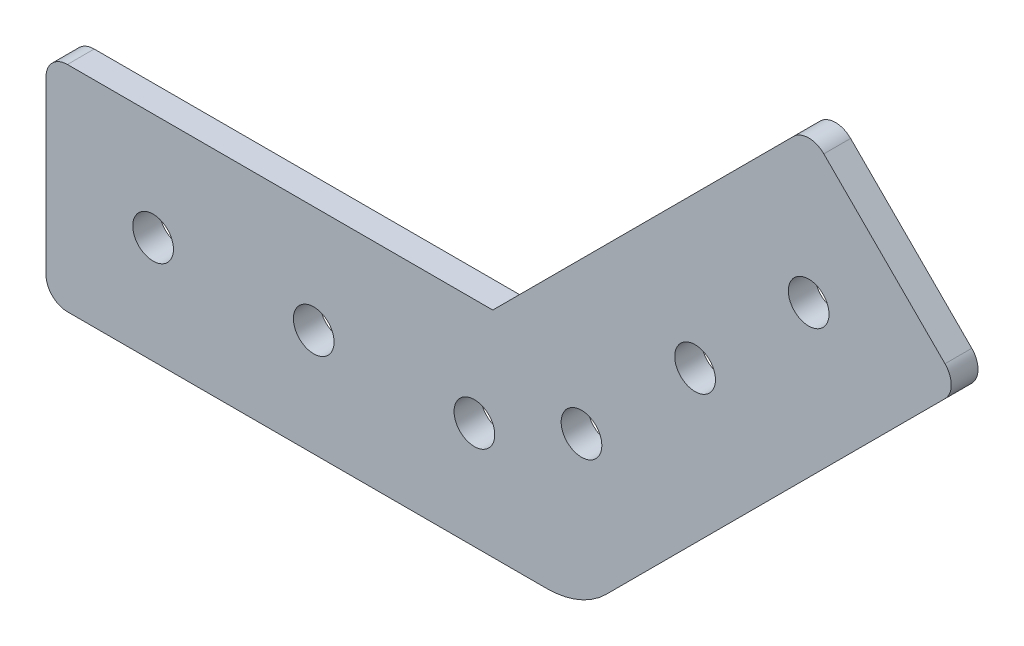
ISO-10303-21;
HEADER;
FILE_DESCRIPTION(('STEP AP214'),'2;1');
FILE_NAME('part.step','',(''),(''),'','','');
FILE_SCHEMA(('AUTOMOTIVE_DESIGN { 1 0 10303 214 1 1 1 1 }'));
ENDSEC;
DATA;
#1=APPLICATION_CONTEXT('core data for automotive mechanical design processes');
#2=APPLICATION_PROTOCOL_DEFINITION('international standard','automotive_design',2000,#1);
#3=PRODUCT_CONTEXT('',#1,'mechanical');
#4=PRODUCT('Part','Part','',(#3));
#5=PRODUCT_RELATED_PRODUCT_CATEGORY('part','',(#4));
#6=PRODUCT_DEFINITION_FORMATION('','',#4);
#7=PRODUCT_DEFINITION_CONTEXT('part definition',#1,'design');
#8=PRODUCT_DEFINITION('design','',#6,#7);
#9=PRODUCT_DEFINITION_SHAPE('','',#8);
#10=(LENGTH_UNIT() NAMED_UNIT(*) SI_UNIT(.MILLI.,.METRE.));
#11=(NAMED_UNIT(*) PLANE_ANGLE_UNIT() SI_UNIT($,.RADIAN.));
#12=(NAMED_UNIT(*) SI_UNIT($,.STERADIAN.) SOLID_ANGLE_UNIT());
#13=UNCERTAINTY_MEASURE_WITH_UNIT(LENGTH_MEASURE(1.E-05),#10,'distance_accuracy_value','');
#14=(GEOMETRIC_REPRESENTATION_CONTEXT(3) GLOBAL_UNCERTAINTY_ASSIGNED_CONTEXT((#13)) GLOBAL_UNIT_ASSIGNED_CONTEXT((#10,
#11,#12)) REPRESENTATION_CONTEXT('',''));
#15=CARTESIAN_POINT('',(0.,0.,0.));
#16=DIRECTION('',(0.,0.,1.));
#17=DIRECTION('',(1.,0.,0.));
#18=AXIS2_PLACEMENT_3D('',#15,#16,#17);
#19=CARTESIAN_POINT('',(0.,0.,3.175));
#20=DIRECTION('',(0.,0.,1.));
#21=DIRECTION('',(1.,0.,0.));
#22=AXIS2_PLACEMENT_3D('',#19,#20,#21);
#23=PLANE('',#22);
#24=CARTESIAN_POINT('',(63.5,17.9605122421383,3.175));
#25=DIRECTION('',(0.,0.,1.));
#26=DIRECTION('',(1.,0.,0.));
#27=AXIS2_PLACEMENT_3D('',#24,#25,#26);
#28=CIRCLE('',#27,2.413);
#29=CARTESIAN_POINT('',(65.913,17.9605122421383,3.175));
#30=VERTEX_POINT('',#29);
#31=EDGE_CURVE('E242',#30,#30,#28,.T.);
#32=ORIENTED_EDGE('',*,*,#31,.F.);
#33=EDGE_LOOP('',(#32));
#34=FACE_BOUND('',#33,.T.);
#35=CARTESIAN_POINT('',(76.9703841816037,31.430896423742,3.175));
#36=DIRECTION('',(0.,0.,1.));
#37=DIRECTION('',(1.,0.,0.));
#38=AXIS2_PLACEMENT_3D('',#35,#36,#37);
#39=CIRCLE('',#38,2.41299999999999);
#40=CARTESIAN_POINT('',(79.3833841816037,31.430896423742,3.175));
#41=VERTEX_POINT('',#40);
#42=EDGE_CURVE('E230',#41,#41,#39,.T.);
#43=ORIENTED_EDGE('',*,*,#42,.F.);
#44=EDGE_LOOP('',(#43));
#45=FACE_BOUND('',#44,.T.);
#46=CARTESIAN_POINT('',(12.7,12.7,3.175));
#47=DIRECTION('',(0.,0.,1.));
#48=DIRECTION('',(1.,0.,0.));
#49=AXIS2_PLACEMENT_3D('',#46,#47,#48);
#50=CIRCLE('',#49,2.413);
#51=CARTESIAN_POINT('',(15.113,12.7,3.175));
#52=VERTEX_POINT('',#51);
#53=EDGE_CURVE('E151',#52,#52,#50,.T.);
#54=ORIENTED_EDGE('',*,*,#53,.F.);
#55=EDGE_LOOP('',(#54));
#56=FACE_BOUND('',#55,.T.);
#57=DIRECTION('',(-0.707106781186548,0.707106781186547,0.));
#58=VECTOR('',#57,1.);
#59=CARTESIAN_POINT('',(108.401280605346,44.9012806053458,3.175));
#60=LINE('',#59,#58);
#61=CARTESIAN_POINT('',(106.605229381132,46.6973318295596,3.175));
#62=VERTEX_POINT('',#61);
#63=CARTESIAN_POINT('',(92.2368195874213,61.0657416232702,3.175));
#64=VERTEX_POINT('',#63);
#65=EDGE_CURVE('E129',#62,#64,#60,.T.);
#66=ORIENTED_EDGE('',*,*,#65,.T.);
#67=CARTESIAN_POINT('',(90.4407683632074,59.2696903990564,3.175));
#68=DIRECTION('',(0.,0.,1.));
#69=DIRECTION('',(1.,0.,0.));
#70=AXIS2_PLACEMENT_3D('',#67,#68,#69);
#71=CIRCLE('',#70,2.54);
#72=CARTESIAN_POINT('',(88.6447171389936,61.0657416232702,3.175));
#73=VERTEX_POINT('',#72);
#74=EDGE_CURVE('E125',#64,#73,#71,.T.);
#75=ORIENTED_EDGE('',*,*,#74,.T.);
#76=DIRECTION('',(-0.707106781186547,-0.707106781186548,0.));
#77=VECTOR('',#76,1.);
#78=CARTESIAN_POINT('',(90.4407683632074,62.8617928474841,3.175));
#79=LINE('',#78,#77);
#80=CARTESIAN_POINT('',(52.9789755157234,25.4,3.175));
#81=VERTEX_POINT('',#80);
#82=EDGE_CURVE('E117',#73,#81,#79,.T.);
#83=ORIENTED_EDGE('',*,*,#82,.T.);
#84=DIRECTION('',(-1.,0.,0.));
#85=VECTOR('',#84,1.);
#86=CARTESIAN_POINT('',(52.9789755157234,25.4,3.175));
#87=LINE('',#86,#85);
#88=CARTESIAN_POINT('',(2.54,25.4,3.175));
#89=VERTEX_POINT('',#88);
#90=EDGE_CURVE('E122',#81,#89,#87,.T.);
#91=ORIENTED_EDGE('',*,*,#90,.T.);
#92=CARTESIAN_POINT('',(2.54,22.86,3.175));
#93=DIRECTION('',(0.,0.,1.));
#94=DIRECTION('',(1.,0.,0.));
#95=AXIS2_PLACEMENT_3D('',#92,#93,#94);
#96=CIRCLE('',#95,2.54);
#97=CARTESIAN_POINT('',(0.,22.86,3.175));
#98=VERTEX_POINT('',#97);
#99=EDGE_CURVE('E178',#89,#98,#96,.T.);
#100=ORIENTED_EDGE('',*,*,#99,.T.);
#101=DIRECTION('',(0.,-1.,0.));
#102=VECTOR('',#101,1.);
#103=CARTESIAN_POINT('',(0.,25.4,3.175));
#104=LINE('',#103,#102);
#105=CARTESIAN_POINT('',(0.,2.54,3.175));
#106=VERTEX_POINT('',#105);
#107=EDGE_CURVE('E160',#98,#106,#104,.T.);
#108=ORIENTED_EDGE('',*,*,#107,.T.);
#109=CARTESIAN_POINT('',(2.54,2.54,3.175));
#110=DIRECTION('',(0.,0.,1.));
#111=DIRECTION('',(1.,0.,0.));
#112=AXIS2_PLACEMENT_3D('',#109,#110,#111);
#113=CIRCLE('',#112,2.54);
#114=CARTESIAN_POINT('',(2.54,0.,3.175));
#115=VERTEX_POINT('',#114);
#116=EDGE_CURVE('E56',#106,#115,#113,.T.);
#117=ORIENTED_EDGE('',*,*,#116,.T.);
#118=DIRECTION('',(1.,0.,0.));
#119=VECTOR('',#118,1.);
#120=CARTESIAN_POINT('',(0.,0.,3.175));
#121=LINE('',#120,#119);
#122=CARTESIAN_POINT('',(59.357864376269,0.,3.175));
#123=VERTEX_POINT('',#122);
#124=EDGE_CURVE('E202',#115,#123,#121,.T.);
#125=ORIENTED_EDGE('',*,*,#124,.T.);
#126=CARTESIAN_POINT('',(59.357864376269,10.,3.175));
#127=DIRECTION('',(0.,0.,1.));
#128=DIRECTION('',(1.,0.,0.));
#129=AXIS2_PLACEMENT_3D('',#126,#127,#128);
#130=CIRCLE('',#129,10.);
#131=CARTESIAN_POINT('',(66.4289321881345,2.92893218813453,3.175));
#132=VERTEX_POINT('',#131);
#133=EDGE_CURVE('E170',#123,#132,#130,.T.);
#134=ORIENTED_EDGE('',*,*,#133,.T.);
#135=DIRECTION('',(0.707106781186547,0.707106781186548,0.));
#136=VECTOR('',#135,1.);
#137=CARTESIAN_POINT('',(63.5,0.,3.175));
#138=LINE('',#137,#136);
#139=CARTESIAN_POINT('',(106.605229381132,43.1052293811319,3.175));
#140=VERTEX_POINT('',#139);
#141=EDGE_CURVE('E214',#132,#140,#138,.T.);
#142=ORIENTED_EDGE('',*,*,#141,.T.);
#143=CARTESIAN_POINT('',(104.809178156918,44.9012806053458,3.175));
#144=DIRECTION('',(0.,0.,1.));
#145=DIRECTION('',(1.,0.,0.));
#146=AXIS2_PLACEMENT_3D('',#143,#144,#145);
#147=CIRCLE('',#146,2.54);
#148=EDGE_CURVE('E194',#140,#62,#147,.T.);
#149=ORIENTED_EDGE('',*,*,#148,.T.);
#150=EDGE_LOOP('',(#66,#75,#83,#91,#100,#108,#117,#125,#134,#142,#149));
#151=FACE_BOUND('',#150,.T.);
#152=CARTESIAN_POINT('',(31.75,12.7,3.175));
#153=DIRECTION('',(0.,0.,1.));
#154=DIRECTION('',(1.,0.,0.));
#155=AXIS2_PLACEMENT_3D('',#152,#153,#154);
#156=CIRCLE('',#155,2.41299999999999);
#157=CARTESIAN_POINT('',(34.163,12.7,3.175));
#158=VERTEX_POINT('',#157);
#159=EDGE_CURVE('E224',#158,#158,#156,.T.);
#160=ORIENTED_EDGE('',*,*,#159,.F.);
#161=EDGE_LOOP('',(#160));
#162=FACE_BOUND('',#161,.T.);
#163=CARTESIAN_POINT('',(90.4407683632074,44.9012806053458,3.175));
#164=DIRECTION('',(0.,0.,1.));
#165=DIRECTION('',(1.,0.,0.));
#166=AXIS2_PLACEMENT_3D('',#163,#164,#165);
#167=CIRCLE('',#166,2.41299999999999);
#168=CARTESIAN_POINT('',(92.8537683632074,44.9012806053458,3.175));
#169=VERTEX_POINT('',#168);
#170=EDGE_CURVE('E236',#169,#169,#167,.T.);
#171=ORIENTED_EDGE('',*,*,#170,.F.);
#172=EDGE_LOOP('',(#171));
#173=FACE_BOUND('',#172,.T.);
#174=CARTESIAN_POINT('',(50.8,12.7,3.175));
#175=DIRECTION('',(0.,0.,1.));
#176=DIRECTION('',(1.,0.,0.));
#177=AXIS2_PLACEMENT_3D('',#174,#175,#176);
#178=CIRCLE('',#177,2.41299999999999);
#179=CARTESIAN_POINT('',(53.213,12.7,3.175));
#180=VERTEX_POINT('',#179);
#181=EDGE_CURVE('E248',#180,#180,#178,.T.);
#182=ORIENTED_EDGE('',*,*,#181,.F.);
#183=EDGE_LOOP('',(#182));
#184=FACE_BOUND('',#183,.T.);
#185=ADVANCED_FACE('F33',(#34,#45,#56,#151,#162,#173,#184),#23,.T.);
#186=CARTESIAN_POINT('',(0.,0.,0.));
#187=DIRECTION('',(0.,0.,1.));
#188=DIRECTION('',(1.,0.,0.));
#189=AXIS2_PLACEMENT_3D('',#186,#187,#188);
#190=PLANE('',#189);
#191=DIRECTION('',(-0.707106781186547,-0.707106781186548,0.));
#192=VECTOR('',#191,1.);
#193=CARTESIAN_POINT('',(90.4407683632074,62.8617928474841,0.));
#194=LINE('',#193,#192);
#195=CARTESIAN_POINT('',(88.6447171389936,61.0657416232702,0.));
#196=VERTEX_POINT('',#195);
#197=CARTESIAN_POINT('',(52.9789755157234,25.4,0.));
#198=VERTEX_POINT('',#197);
#199=EDGE_CURVE('E135',#196,#198,#194,.T.);
#200=ORIENTED_EDGE('',*,*,#199,.F.);
#201=CARTESIAN_POINT('',(90.4407683632074,59.2696903990564,0.));
#202=DIRECTION('',(0.,0.,1.));
#203=DIRECTION('',(1.,0.,0.));
#204=AXIS2_PLACEMENT_3D('',#201,#202,#203);
#205=CIRCLE('',#204,2.54);
#206=CARTESIAN_POINT('',(92.2368195874213,61.0657416232702,0.));
#207=VERTEX_POINT('',#206);
#208=EDGE_CURVE('E186',#196,#207,#205,.F.);
#209=ORIENTED_EDGE('',*,*,#208,.T.);
#210=DIRECTION('',(-0.707106781186548,0.707106781186547,0.));
#211=VECTOR('',#210,1.);
#212=CARTESIAN_POINT('',(108.401280605346,44.9012806053458,0.));
#213=LINE('',#212,#211);
#214=CARTESIAN_POINT('',(106.605229381132,46.6973318295596,0.));
#215=VERTEX_POINT('',#214);
#216=EDGE_CURVE('E155',#215,#207,#213,.T.);
#217=ORIENTED_EDGE('',*,*,#216,.F.);
#218=CARTESIAN_POINT('',(104.809178156918,44.9012806053458,0.));
#219=DIRECTION('',(0.,0.,1.));
#220=DIRECTION('',(1.,0.,0.));
#221=AXIS2_PLACEMENT_3D('',#218,#219,#220);
#222=CIRCLE('',#221,2.54);
#223=CARTESIAN_POINT('',(106.605229381132,43.1052293811319,0.));
#224=VERTEX_POINT('',#223);
#225=EDGE_CURVE('E184',#215,#224,#222,.F.);
#226=ORIENTED_EDGE('',*,*,#225,.T.);
#227=DIRECTION('',(0.707106781186547,0.707106781186548,0.));
#228=VECTOR('',#227,1.);
#229=CARTESIAN_POINT('',(63.5,0.,0.));
#230=LINE('',#229,#228);
#231=CARTESIAN_POINT('',(66.4289321881345,2.92893218813453,0.));
#232=VERTEX_POINT('',#231);
#233=EDGE_CURVE('E153',#232,#224,#230,.T.);
#234=ORIENTED_EDGE('',*,*,#233,.F.);
#235=CARTESIAN_POINT('',(59.357864376269,10.,0.));
#236=DIRECTION('',(0.,0.,1.));
#237=DIRECTION('',(1.,0.,0.));
#238=AXIS2_PLACEMENT_3D('',#235,#236,#237);
#239=CIRCLE('',#238,10.);
#240=CARTESIAN_POINT('',(59.357864376269,0.,0.));
#241=VERTEX_POINT('',#240);
#242=EDGE_CURVE('E164',#232,#241,#239,.F.);
#243=ORIENTED_EDGE('',*,*,#242,.T.);
#244=DIRECTION('',(1.,0.,0.));
#245=VECTOR('',#244,1.);
#246=CARTESIAN_POINT('',(0.,0.,0.));
#247=LINE('',#246,#245);
#248=CARTESIAN_POINT('',(2.54,0.,0.));
#249=VERTEX_POINT('',#248);
#250=EDGE_CURVE('E150',#249,#241,#247,.T.);
#251=ORIENTED_EDGE('',*,*,#250,.F.);
#252=CARTESIAN_POINT('',(2.54,2.54,0.));
#253=DIRECTION('',(0.,0.,1.));
#254=DIRECTION('',(1.,0.,0.));
#255=AXIS2_PLACEMENT_3D('',#252,#253,#254);
#256=CIRCLE('',#255,2.54);
#257=CARTESIAN_POINT('',(0.,2.54,0.));
#258=VERTEX_POINT('',#257);
#259=EDGE_CURVE('E182',#249,#258,#256,.F.);
#260=ORIENTED_EDGE('',*,*,#259,.T.);
#261=DIRECTION('',(0.,-1.,0.));
#262=VECTOR('',#261,1.);
#263=CARTESIAN_POINT('',(0.,25.4,0.));
#264=LINE('',#263,#262);
#265=CARTESIAN_POINT('',(0.,22.86,0.));
#266=VERTEX_POINT('',#265);
#267=EDGE_CURVE('E147',#266,#258,#264,.T.);
#268=ORIENTED_EDGE('',*,*,#267,.F.);
#269=CARTESIAN_POINT('',(2.54,22.86,0.));
#270=DIRECTION('',(0.,0.,1.));
#271=DIRECTION('',(1.,0.,0.));
#272=AXIS2_PLACEMENT_3D('',#269,#270,#271);
#273=CIRCLE('',#272,2.54);
#274=CARTESIAN_POINT('',(2.54,25.4,0.));
#275=VERTEX_POINT('',#274);
#276=EDGE_CURVE('E175',#266,#275,#273,.F.);
#277=ORIENTED_EDGE('',*,*,#276,.T.);
#278=DIRECTION('',(-1.,0.,0.));
#279=VECTOR('',#278,1.);
#280=CARTESIAN_POINT('',(52.9789755157234,25.4,0.));
#281=LINE('',#280,#279);
#282=EDGE_CURVE('E159',#198,#275,#281,.T.);
#283=ORIENTED_EDGE('',*,*,#282,.F.);
#284=EDGE_LOOP('',(#200,#209,#217,#226,#234,#243,#251,#260,#268,#277,#283));
#285=FACE_BOUND('',#284,.T.);
#286=CARTESIAN_POINT('',(12.7,12.7,0.));
#287=DIRECTION('',(0.,0.,1.));
#288=DIRECTION('',(1.,0.,0.));
#289=AXIS2_PLACEMENT_3D('',#286,#287,#288);
#290=CIRCLE('',#289,2.413);
#291=CARTESIAN_POINT('',(15.113,12.7,0.));
#292=VERTEX_POINT('',#291);
#293=EDGE_CURVE('E221',#292,#292,#290,.T.);
#294=ORIENTED_EDGE('',*,*,#293,.T.);
#295=EDGE_LOOP('',(#294));
#296=FACE_BOUND('',#295,.T.);
#297=CARTESIAN_POINT('',(31.75,12.7,0.));
#298=DIRECTION('',(0.,0.,1.));
#299=DIRECTION('',(1.,0.,0.));
#300=AXIS2_PLACEMENT_3D('',#297,#298,#299);
#301=CIRCLE('',#300,2.41299999999999);
#302=CARTESIAN_POINT('',(34.163,12.7,0.));
#303=VERTEX_POINT('',#302);
#304=EDGE_CURVE('E227',#303,#303,#301,.T.);
#305=ORIENTED_EDGE('',*,*,#304,.T.);
#306=EDGE_LOOP('',(#305));
#307=FACE_BOUND('',#306,.T.);
#308=CARTESIAN_POINT('',(76.9703841816037,31.430896423742,0.));
#309=DIRECTION('',(0.,0.,1.));
#310=DIRECTION('',(1.,0.,0.));
#311=AXIS2_PLACEMENT_3D('',#308,#309,#310);
#312=CIRCLE('',#311,2.41299999999999);
#313=CARTESIAN_POINT('',(79.3833841816037,31.430896423742,0.));
#314=VERTEX_POINT('',#313);
#315=EDGE_CURVE('E233',#314,#314,#312,.T.);
#316=ORIENTED_EDGE('',*,*,#315,.T.);
#317=EDGE_LOOP('',(#316));
#318=FACE_BOUND('',#317,.T.);
#319=CARTESIAN_POINT('',(90.4407683632074,44.9012806053458,0.));
#320=DIRECTION('',(0.,0.,1.));
#321=DIRECTION('',(1.,0.,0.));
#322=AXIS2_PLACEMENT_3D('',#319,#320,#321);
#323=CIRCLE('',#322,2.41299999999999);
#324=CARTESIAN_POINT('',(92.8537683632074,44.9012806053458,0.));
#325=VERTEX_POINT('',#324);
#326=EDGE_CURVE('E239',#325,#325,#323,.T.);
#327=ORIENTED_EDGE('',*,*,#326,.T.);
#328=EDGE_LOOP('',(#327));
#329=FACE_BOUND('',#328,.T.);
#330=CARTESIAN_POINT('',(63.5,17.9605122421383,0.));
#331=DIRECTION('',(0.,0.,1.));
#332=DIRECTION('',(1.,0.,0.));
#333=AXIS2_PLACEMENT_3D('',#330,#331,#332);
#334=CIRCLE('',#333,2.413);
#335=CARTESIAN_POINT('',(65.913,17.9605122421383,0.));
#336=VERTEX_POINT('',#335);
#337=EDGE_CURVE('E245',#336,#336,#334,.T.);
#338=ORIENTED_EDGE('',*,*,#337,.T.);
#339=EDGE_LOOP('',(#338));
#340=FACE_BOUND('',#339,.T.);
#341=CARTESIAN_POINT('',(50.8,12.7,0.));
#342=DIRECTION('',(0.,0.,1.));
#343=DIRECTION('',(1.,0.,0.));
#344=AXIS2_PLACEMENT_3D('',#341,#342,#343);
#345=CIRCLE('',#344,2.41299999999999);
#346=CARTESIAN_POINT('',(53.213,12.7,0.));
#347=VERTEX_POINT('',#346);
#348=EDGE_CURVE('E251',#347,#347,#345,.T.);
#349=ORIENTED_EDGE('',*,*,#348,.T.);
#350=EDGE_LOOP('',(#349));
#351=FACE_BOUND('',#350,.T.);
#352=ADVANCED_FACE('F205',(#285,#296,#307,#318,#329,#340,#351),#190,.F.);
#353=CARTESIAN_POINT('',(0.,25.4,3.175));
#354=DIRECTION('',(1.,0.,0.));
#355=DIRECTION('',(0.,1.,0.));
#356=AXIS2_PLACEMENT_3D('',#353,#354,#355);
#357=PLANE('',#356);
#358=ORIENTED_EDGE('',*,*,#267,.T.);
#359=DIRECTION('',(0.,0.,-1.));
#360=VECTOR('',#359,1.);
#361=CARTESIAN_POINT('',(0.,2.54,3.175));
#362=LINE('',#361,#360);
#363=EDGE_CURVE('E11',#258,#106,#362,.F.);
#364=ORIENTED_EDGE('',*,*,#363,.T.);
#365=ORIENTED_EDGE('',*,*,#107,.F.);
#366=DIRECTION('',(0.,0.,-1.));
#367=VECTOR('',#366,1.);
#368=CARTESIAN_POINT('',(0.,22.86,3.175));
#369=LINE('',#368,#367);
#370=EDGE_CURVE('E172',#98,#266,#369,.T.);
#371=ORIENTED_EDGE('',*,*,#370,.T.);
#372=EDGE_LOOP('',(#358,#364,#365,#371));
#373=FACE_BOUND('',#372,.T.);
#374=ADVANCED_FACE('F266',(#373),#357,.F.);
#375=CARTESIAN_POINT('',(0.,0.,3.175));
#376=DIRECTION('',(0.,1.,0.));
#377=DIRECTION('',(0.,0.,1.));
#378=AXIS2_PLACEMENT_3D('',#375,#376,#377);
#379=PLANE('',#378);
#380=ORIENTED_EDGE('',*,*,#124,.F.);
#381=DIRECTION('',(0.,0.,-1.));
#382=VECTOR('',#381,1.);
#383=CARTESIAN_POINT('',(2.54,0.,3.175));
#384=LINE('',#383,#382);
#385=EDGE_CURVE('E41',#115,#249,#384,.T.);
#386=ORIENTED_EDGE('',*,*,#385,.T.);
#387=ORIENTED_EDGE('',*,*,#250,.T.);
#388=DIRECTION('',(0.,0.,-1.));
#389=VECTOR('',#388,1.);
#390=CARTESIAN_POINT('',(59.357864376269,0.,3.175));
#391=LINE('',#390,#389);
#392=EDGE_CURVE('E167',#241,#123,#391,.F.);
#393=ORIENTED_EDGE('',*,*,#392,.T.);
#394=EDGE_LOOP('',(#380,#386,#387,#393));
#395=FACE_BOUND('',#394,.T.);
#396=ADVANCED_FACE('F201',(#395),#379,.F.);
#397=CARTESIAN_POINT('',(63.5,0.,3.175));
#398=DIRECTION('',(-0.707106781186548,0.707106781186547,0.));
#399=DIRECTION('',(-0.707106781186547,-0.707106781186548,0.));
#400=AXIS2_PLACEMENT_3D('',#397,#398,#399);
#401=PLANE('',#400);
#402=ORIENTED_EDGE('',*,*,#233,.T.);
#403=DIRECTION('',(0.,0.,-1.));
#404=VECTOR('',#403,1.);
#405=CARTESIAN_POINT('',(106.605229381132,43.1052293811319,3.175));
#406=LINE('',#405,#404);
#407=EDGE_CURVE('E48',#224,#140,#406,.F.);
#408=ORIENTED_EDGE('',*,*,#407,.T.);
#409=ORIENTED_EDGE('',*,*,#141,.F.);
#410=DIRECTION('',(0.,0.,-1.));
#411=VECTOR('',#410,1.);
#412=CARTESIAN_POINT('',(66.4289321881345,2.92893218813453,3.175));
#413=LINE('',#412,#411);
#414=EDGE_CURVE('E139',#132,#232,#413,.T.);
#415=ORIENTED_EDGE('',*,*,#414,.T.);
#416=EDGE_LOOP('',(#402,#408,#409,#415));
#417=FACE_BOUND('',#416,.T.);
#418=ADVANCED_FACE('F216',(#417),#401,.F.);
#419=CARTESIAN_POINT('',(108.401280605346,44.9012806053458,3.175));
#420=DIRECTION('',(-0.707106781186547,-0.707106781186548,0.));
#421=DIRECTION('',(0.707106781186548,-0.707106781186547,0.));
#422=AXIS2_PLACEMENT_3D('',#419,#420,#421);
#423=PLANE('',#422);
#424=ORIENTED_EDGE('',*,*,#216,.T.);
#425=DIRECTION('',(0.,0.,-1.));
#426=VECTOR('',#425,1.);
#427=CARTESIAN_POINT('',(92.2368195874213,61.0657416232702,3.175));
#428=LINE('',#427,#426);
#429=EDGE_CURVE('E191',#207,#64,#428,.F.);
#430=ORIENTED_EDGE('',*,*,#429,.T.);
#431=ORIENTED_EDGE('',*,*,#65,.F.);
#432=DIRECTION('',(0.,0.,-1.));
#433=VECTOR('',#432,1.);
#434=CARTESIAN_POINT('',(106.605229381132,46.6973318295596,3.175));
#435=LINE('',#434,#433);
#436=EDGE_CURVE('E188',#62,#215,#435,.T.);
#437=ORIENTED_EDGE('',*,*,#436,.T.);
#438=EDGE_LOOP('',(#424,#430,#431,#437));
#439=FACE_BOUND('',#438,.T.);
#440=ADVANCED_FACE('F278',(#439),#423,.F.);
#441=CARTESIAN_POINT('',(90.4407683632074,62.8617928474841,3.175));
#442=DIRECTION('',(0.707106781186548,-0.707106781186547,0.));
#443=DIRECTION('',(0.707106781186547,0.707106781186548,0.));
#444=AXIS2_PLACEMENT_3D('',#441,#442,#443);
#445=PLANE('',#444);
#446=ORIENTED_EDGE('',*,*,#82,.F.);
#447=DIRECTION('',(0.,0.,-1.));
#448=VECTOR('',#447,1.);
#449=CARTESIAN_POINT('',(88.6447171389936,61.0657416232702,3.175));
#450=LINE('',#449,#448);
#451=EDGE_CURVE('E180',#73,#196,#450,.T.);
#452=ORIENTED_EDGE('',*,*,#451,.T.);
#453=ORIENTED_EDGE('',*,*,#199,.T.);
#454=DIRECTION('',(0.,0.,-1.));
#455=VECTOR('',#454,1.);
#456=CARTESIAN_POINT('',(52.9789755157234,25.4,3.175));
#457=LINE('',#456,#455);
#458=EDGE_CURVE('E132',#81,#198,#457,.T.);
#459=ORIENTED_EDGE('',*,*,#458,.F.);
#460=EDGE_LOOP('',(#446,#452,#453,#459));
#461=FACE_BOUND('',#460,.T.);
#462=ADVANCED_FACE('F133',(#461),#445,.F.);
#463=CARTESIAN_POINT('',(52.9789755157234,25.4,3.175));
#464=DIRECTION('',(0.,-1.,0.));
#465=DIRECTION('',(1.,0.,0.));
#466=AXIS2_PLACEMENT_3D('',#463,#464,#465);
#467=PLANE('',#466);
#468=ORIENTED_EDGE('',*,*,#282,.T.);
#469=DIRECTION('',(0.,0.,-1.));
#470=VECTOR('',#469,1.);
#471=CARTESIAN_POINT('',(2.54,25.4,3.175));
#472=LINE('',#471,#470);
#473=EDGE_CURVE('E143',#275,#89,#472,.F.);
#474=ORIENTED_EDGE('',*,*,#473,.T.);
#475=ORIENTED_EDGE('',*,*,#90,.F.);
#476=ORIENTED_EDGE('',*,*,#458,.T.);
#477=EDGE_LOOP('',(#468,#474,#475,#476));
#478=FACE_BOUND('',#477,.T.);
#479=ADVANCED_FACE('F141',(#478),#467,.F.);
#480=CARTESIAN_POINT('',(12.7,12.7,3.175));
#481=DIRECTION('',(0.,0.,-1.));
#482=DIRECTION('',(-1.,0.,0.));
#483=AXIS2_PLACEMENT_3D('',#480,#481,#482);
#484=CYLINDRICAL_SURFACE('',#483,2.413);
#485=ORIENTED_EDGE('',*,*,#53,.T.);
#486=EDGE_LOOP('',(#485));
#487=FACE_BOUND('',#486,.T.);
#488=ORIENTED_EDGE('',*,*,#293,.F.);
#489=EDGE_LOOP('',(#488));
#490=FACE_BOUND('',#489,.T.);
#491=ADVANCED_FACE('F271',(#487,#490),#484,.F.);
#492=CARTESIAN_POINT('',(31.75,12.7,3.175));
#493=DIRECTION('',(0.,0.,-1.));
#494=DIRECTION('',(-1.,0.,0.));
#495=AXIS2_PLACEMENT_3D('',#492,#493,#494);
#496=CYLINDRICAL_SURFACE('',#495,2.41299999999999);
#497=ORIENTED_EDGE('',*,*,#159,.T.);
#498=EDGE_LOOP('',(#497));
#499=FACE_BOUND('',#498,.T.);
#500=ORIENTED_EDGE('',*,*,#304,.F.);
#501=EDGE_LOOP('',(#500));
#502=FACE_BOUND('',#501,.T.);
#503=ADVANCED_FACE('F421',(#499,#502),#496,.F.);
#504=CARTESIAN_POINT('',(76.9703841816037,31.430896423742,3.175));
#505=DIRECTION('',(0.,0.,-1.));
#506=DIRECTION('',(-1.,0.,0.));
#507=AXIS2_PLACEMENT_3D('',#504,#505,#506);
#508=CYLINDRICAL_SURFACE('',#507,2.41299999999999);
#509=ORIENTED_EDGE('',*,*,#42,.T.);
#510=EDGE_LOOP('',(#509));
#511=FACE_BOUND('',#510,.T.);
#512=ORIENTED_EDGE('',*,*,#315,.F.);
#513=EDGE_LOOP('',(#512));
#514=FACE_BOUND('',#513,.T.);
#515=ADVANCED_FACE('F411',(#511,#514),#508,.F.);
#516=CARTESIAN_POINT('',(90.4407683632074,44.9012806053458,3.175));
#517=DIRECTION('',(0.,0.,-1.));
#518=DIRECTION('',(-1.,0.,0.));
#519=AXIS2_PLACEMENT_3D('',#516,#517,#518);
#520=CYLINDRICAL_SURFACE('',#519,2.41299999999999);
#521=ORIENTED_EDGE('',*,*,#170,.T.);
#522=EDGE_LOOP('',(#521));
#523=FACE_BOUND('',#522,.T.);
#524=ORIENTED_EDGE('',*,*,#326,.F.);
#525=EDGE_LOOP('',(#524));
#526=FACE_BOUND('',#525,.T.);
#527=ADVANCED_FACE('F401',(#523,#526),#520,.F.);
#528=CARTESIAN_POINT('',(63.5,17.9605122421383,3.175));
#529=DIRECTION('',(0.,0.,-1.));
#530=DIRECTION('',(-1.,0.,0.));
#531=AXIS2_PLACEMENT_3D('',#528,#529,#530);
#532=CYLINDRICAL_SURFACE('',#531,2.413);
#533=ORIENTED_EDGE('',*,*,#31,.T.);
#534=EDGE_LOOP('',(#533));
#535=FACE_BOUND('',#534,.T.);
#536=ORIENTED_EDGE('',*,*,#337,.F.);
#537=EDGE_LOOP('',(#536));
#538=FACE_BOUND('',#537,.T.);
#539=ADVANCED_FACE('F392',(#535,#538),#532,.F.);
#540=CARTESIAN_POINT('',(50.8,12.7,3.175));
#541=DIRECTION('',(0.,0.,-1.));
#542=DIRECTION('',(-1.,0.,0.));
#543=AXIS2_PLACEMENT_3D('',#540,#541,#542);
#544=CYLINDRICAL_SURFACE('',#543,2.41299999999999);
#545=ORIENTED_EDGE('',*,*,#181,.T.);
#546=EDGE_LOOP('',(#545));
#547=FACE_BOUND('',#546,.T.);
#548=ORIENTED_EDGE('',*,*,#348,.F.);
#549=EDGE_LOOP('',(#548));
#550=FACE_BOUND('',#549,.T.);
#551=ADVANCED_FACE('F257',(#547,#550),#544,.F.);
#552=CARTESIAN_POINT('',(59.357864376269,10.,3.175));
#553=DIRECTION('',(0.,0.,-1.));
#554=DIRECTION('',(-1.,0.,0.));
#555=AXIS2_PLACEMENT_3D('',#552,#553,#554);
#556=CYLINDRICAL_SURFACE('',#555,10.);
#557=ORIENTED_EDGE('',*,*,#133,.F.);
#558=ORIENTED_EDGE('',*,*,#392,.F.);
#559=ORIENTED_EDGE('',*,*,#242,.F.);
#560=ORIENTED_EDGE('',*,*,#414,.F.);
#561=EDGE_LOOP('',(#557,#558,#559,#560));
#562=FACE_BOUND('',#561,.T.);
#563=ADVANCED_FACE('F213',(#562),#556,.T.);
#564=CARTESIAN_POINT('',(2.54,22.86,3.175));
#565=DIRECTION('',(0.,0.,-1.));
#566=DIRECTION('',(-1.,0.,0.));
#567=AXIS2_PLACEMENT_3D('',#564,#565,#566);
#568=CYLINDRICAL_SURFACE('',#567,2.54);
#569=ORIENTED_EDGE('',*,*,#99,.F.);
#570=ORIENTED_EDGE('',*,*,#473,.F.);
#571=ORIENTED_EDGE('',*,*,#276,.F.);
#572=ORIENTED_EDGE('',*,*,#370,.F.);
#573=EDGE_LOOP('',(#569,#570,#571,#572));
#574=FACE_BOUND('',#573,.T.);
#575=ADVANCED_FACE('F291',(#574),#568,.T.);
#576=CARTESIAN_POINT('',(90.4407683632074,59.2696903990564,3.175));
#577=DIRECTION('',(0.,0.,-1.));
#578=DIRECTION('',(-1.,0.,0.));
#579=AXIS2_PLACEMENT_3D('',#576,#577,#578);
#580=CYLINDRICAL_SURFACE('',#579,2.54);
#581=ORIENTED_EDGE('',*,*,#74,.F.);
#582=ORIENTED_EDGE('',*,*,#429,.F.);
#583=ORIENTED_EDGE('',*,*,#208,.F.);
#584=ORIENTED_EDGE('',*,*,#451,.F.);
#585=EDGE_LOOP('',(#581,#582,#583,#584));
#586=FACE_BOUND('',#585,.T.);
#587=ADVANCED_FACE('F294',(#586),#580,.T.);
#588=CARTESIAN_POINT('',(104.809178156918,44.9012806053458,3.175));
#589=DIRECTION('',(0.,0.,-1.));
#590=DIRECTION('',(-1.,0.,0.));
#591=AXIS2_PLACEMENT_3D('',#588,#589,#590);
#592=CYLINDRICAL_SURFACE('',#591,2.54);
#593=ORIENTED_EDGE('',*,*,#148,.F.);
#594=ORIENTED_EDGE('',*,*,#407,.F.);
#595=ORIENTED_EDGE('',*,*,#225,.F.);
#596=ORIENTED_EDGE('',*,*,#436,.F.);
#597=EDGE_LOOP('',(#593,#594,#595,#596));
#598=FACE_BOUND('',#597,.T.);
#599=ADVANCED_FACE('F297',(#598),#592,.T.);
#600=CARTESIAN_POINT('',(2.54,2.54,3.175));
#601=DIRECTION('',(0.,0.,-1.));
#602=DIRECTION('',(-1.,0.,0.));
#603=AXIS2_PLACEMENT_3D('',#600,#601,#602);
#604=CYLINDRICAL_SURFACE('',#603,2.54);
#605=ORIENTED_EDGE('',*,*,#116,.F.);
#606=ORIENTED_EDGE('',*,*,#363,.F.);
#607=ORIENTED_EDGE('',*,*,#259,.F.);
#608=ORIENTED_EDGE('',*,*,#385,.F.);
#609=EDGE_LOOP('',(#605,#606,#607,#608));
#610=FACE_BOUND('',#609,.T.);
#611=ADVANCED_FACE('F35',(#610),#604,.T.);
#612=CLOSED_SHELL('',(#185,#352,#374,#396,#418,#440,#462,#479,#491,#503,#515,#527,#539,#551,
#563,#575,#587,#599,#611));
#613=MANIFOLD_SOLID_BREP('B2',#612);
#614=ADVANCED_BREP_SHAPE_REPRESENTATION('',(#18,#613),#14);
#615=SHAPE_DEFINITION_REPRESENTATION(#9,#614);
ENDSEC;
END-ISO-10303-21;
